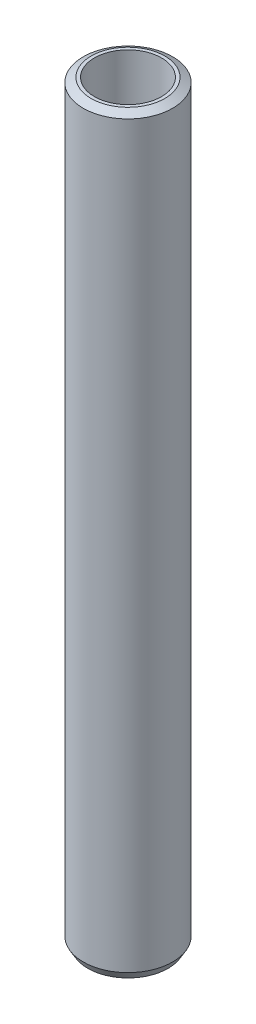
ISO-10303-21;
HEADER;
FILE_DESCRIPTION(('STEP AP214'),'2;1');
FILE_NAME('part.step','',(''),(''),'','','');
FILE_SCHEMA(('AUTOMOTIVE_DESIGN { 1 0 10303 214 1 1 1 1 }'));
ENDSEC;
DATA;
#1=APPLICATION_CONTEXT('core data for automotive mechanical design processes');
#2=APPLICATION_PROTOCOL_DEFINITION('international standard','automotive_design',2000,#1);
#3=PRODUCT_CONTEXT('',#1,'mechanical');
#4=PRODUCT('Part','Part','',(#3));
#5=PRODUCT_RELATED_PRODUCT_CATEGORY('part','',(#4));
#6=PRODUCT_DEFINITION_FORMATION('','',#4);
#7=PRODUCT_DEFINITION_CONTEXT('part definition',#1,'design');
#8=PRODUCT_DEFINITION('design','',#6,#7);
#9=PRODUCT_DEFINITION_SHAPE('','',#8);
#10=(LENGTH_UNIT() NAMED_UNIT(*) SI_UNIT(.MILLI.,.METRE.));
#11=(NAMED_UNIT(*) PLANE_ANGLE_UNIT() SI_UNIT($,.RADIAN.));
#12=(NAMED_UNIT(*) SI_UNIT($,.STERADIAN.) SOLID_ANGLE_UNIT());
#13=UNCERTAINTY_MEASURE_WITH_UNIT(LENGTH_MEASURE(1.E-05),#10,'distance_accuracy_value','');
#14=(GEOMETRIC_REPRESENTATION_CONTEXT(3) GLOBAL_UNCERTAINTY_ASSIGNED_CONTEXT((#13)) GLOBAL_UNIT_ASSIGNED_CONTEXT((#10,
#11,#12)) REPRESENTATION_CONTEXT('',''));
#15=CARTESIAN_POINT('',(0.,0.,0.));
#16=DIRECTION('',(0.,0.,1.));
#17=DIRECTION('',(1.,0.,0.));
#18=AXIS2_PLACEMENT_3D('',#15,#16,#17);
#19=CARTESIAN_POINT('',(0.,588.745721890677,0.));
#20=DIRECTION('',(0.,-1.,0.));
#21=DIRECTION('',(0.,0.,-1.));
#22=AXIS2_PLACEMENT_3D('',#19,#20,#21);
#23=CYLINDRICAL_SURFACE('',#22,35.);
#24=CARTESIAN_POINT('',(0.,585.194170919044,0.));
#25=DIRECTION('',(0.,1.,0.));
#26=DIRECTION('',(0.,0.,1.));
#27=AXIS2_PLACEMENT_3D('',#24,#25,#26);
#28=CIRCLE('',#27,35.);
#29=CARTESIAN_POINT('',(0.,585.194170919044,35.));
#30=VERTEX_POINT('',#29);
#31=EDGE_CURVE('E50',#30,#30,#28,.F.);
#32=ORIENTED_EDGE('',*,*,#31,.T.);
#33=EDGE_LOOP('',(#32));
#34=FACE_BOUND('',#33,.T.);
#35=CARTESIAN_POINT('',(0.,6.15146672853906,0.));
#36=DIRECTION('',(0.,1.,0.));
#37=DIRECTION('',(0.,0.,1.));
#38=AXIS2_PLACEMENT_3D('',#35,#36,#37);
#39=CIRCLE('',#38,35.);
#40=CARTESIAN_POINT('',(0.,6.15146672853906,35.));
#41=VERTEX_POINT('',#40);
#42=EDGE_CURVE('E51',#41,#41,#39,.T.);
#43=ORIENTED_EDGE('',*,*,#42,.T.);
#44=EDGE_LOOP('',(#43));
#45=FACE_BOUND('',#44,.T.);
#46=ADVANCED_FACE('F39',(#34,#45),#23,.T.);
#47=CARTESIAN_POINT('',(0.,588.745721890677,0.));
#48=DIRECTION('',(0.,1.,0.));
#49=DIRECTION('',(0.,0.,1.));
#50=AXIS2_PLACEMENT_3D('',#47,#48,#49);
#51=PLANE('',#50);
#52=CARTESIAN_POINT('',(0.,588.745721890677,0.));
#53=DIRECTION('',(0.,1.,0.));
#54=DIRECTION('',(0.,0.,1.));
#55=AXIS2_PLACEMENT_3D('',#52,#53,#54);
#56=CIRCLE('',#55,28.8485332714608);
#57=CARTESIAN_POINT('',(0.,588.745721890677,28.8485332714608));
#58=VERTEX_POINT('',#57);
#59=EDGE_CURVE('E54',#58,#58,#56,.T.);
#60=ORIENTED_EDGE('',*,*,#59,.T.);
#61=EDGE_LOOP('',(#60));
#62=FACE_BOUND('',#61,.T.);
#63=CARTESIAN_POINT('',(0.,588.745721890677,0.));
#64=DIRECTION('',(0.,1.,0.));
#65=DIRECTION('',(0.,0.,1.));
#66=AXIS2_PLACEMENT_3D('',#63,#64,#65);
#67=CIRCLE('',#66,26.3052880109944);
#68=CARTESIAN_POINT('',(0.,588.745721890677,26.3052880109944));
#69=VERTEX_POINT('',#68);
#70=EDGE_CURVE('E58',#69,#69,#67,.T.);
#71=ORIENTED_EDGE('',*,*,#70,.F.);
#72=EDGE_LOOP('',(#71));
#73=FACE_BOUND('',#72,.T.);
#74=ADVANCED_FACE('F69',(#62,#73),#51,.T.);
#75=CARTESIAN_POINT('',(0.,0.,0.));
#76=DIRECTION('',(0.,1.,0.));
#77=DIRECTION('',(0.,0.,1.));
#78=AXIS2_PLACEMENT_3D('',#75,#76,#77);
#79=PLANE('',#78);
#80=CARTESIAN_POINT('',(0.,0.,0.));
#81=DIRECTION('',(0.,1.,0.));
#82=DIRECTION('',(0.,0.,1.));
#83=AXIS2_PLACEMENT_3D('',#80,#81,#82);
#84=CIRCLE('',#83,31.4484490283669);
#85=CARTESIAN_POINT('',(0.,0.,31.4484490283669));
#86=VERTEX_POINT('',#85);
#87=EDGE_CURVE('E10',#86,#86,#84,.F.);
#88=ORIENTED_EDGE('',*,*,#87,.T.);
#89=EDGE_LOOP('',(#88));
#90=FACE_BOUND('',#89,.T.);
#91=CARTESIAN_POINT('',(0.,0.,0.));
#92=DIRECTION('',(0.,1.,0.));
#93=DIRECTION('',(0.,0.,1.));
#94=AXIS2_PLACEMENT_3D('',#91,#92,#93);
#95=CIRCLE('',#94,26.3052880109944);
#96=CARTESIAN_POINT('',(0.,0.,26.3052880109944));
#97=VERTEX_POINT('',#96);
#98=EDGE_CURVE('E63',#97,#97,#95,.T.);
#99=ORIENTED_EDGE('',*,*,#98,.T.);
#100=EDGE_LOOP('',(#99));
#101=FACE_BOUND('',#100,.T.);
#102=ADVANCED_FACE('F75',(#90,#101),#79,.F.);
#103=CARTESIAN_POINT('',(0.,588.745721890677,0.));
#104=DIRECTION('',(0.,-1.,0.));
#105=DIRECTION('',(0.,0.,-1.));
#106=AXIS2_PLACEMENT_3D('',#103,#104,#105);
#107=CYLINDRICAL_SURFACE('',#106,26.3052880109944);
#108=ORIENTED_EDGE('',*,*,#70,.T.);
#109=EDGE_LOOP('',(#108));
#110=FACE_BOUND('',#109,.T.);
#111=ORIENTED_EDGE('',*,*,#98,.F.);
#112=EDGE_LOOP('',(#111));
#113=FACE_BOUND('',#112,.T.);
#114=ADVANCED_FACE('F70',(#110,#113),#107,.F.);
#115=CARTESIAN_POINT('',(0.,588.745721890677,0.));
#116=DIRECTION('',(0.,-1.,0.));
#117=DIRECTION('',(0.,0.,-1.));
#118=AXIS2_PLACEMENT_3D('',#115,#116,#117);
#119=CONICAL_SURFACE('',#118,28.8485332714608,1.04719755119658);
#120=ORIENTED_EDGE('',*,*,#31,.F.);
#121=EDGE_LOOP('',(#120));
#122=FACE_BOUND('',#121,.T.);
#123=ORIENTED_EDGE('',*,*,#59,.F.);
#124=EDGE_LOOP('',(#123));
#125=FACE_BOUND('',#124,.T.);
#126=ADVANCED_FACE('F81',(#122,#125),#119,.T.);
#127=CARTESIAN_POINT('',(0.,6.15146672853906,0.));
#128=DIRECTION('',(0.,1.,0.));
#129=DIRECTION('',(0.,0.,1.));
#130=AXIS2_PLACEMENT_3D('',#127,#128,#129);
#131=CONICAL_SURFACE('',#130,35.,0.523598775598305);
#132=ORIENTED_EDGE('',*,*,#87,.F.);
#133=EDGE_LOOP('',(#132));
#134=FACE_BOUND('',#133,.T.);
#135=ORIENTED_EDGE('',*,*,#42,.F.);
#136=EDGE_LOOP('',(#135));
#137=FACE_BOUND('',#136,.T.);
#138=ADVANCED_FACE('F45',(#134,#137),#131,.T.);
#139=CLOSED_SHELL('',(#46,#74,#102,#114,#126,#138));
#140=MANIFOLD_SOLID_BREP('B2',#139);
#141=ADVANCED_BREP_SHAPE_REPRESENTATION('',(#18,#140),#14);
#142=SHAPE_DEFINITION_REPRESENTATION(#9,#141);
ENDSEC;
END-ISO-10303-21;
